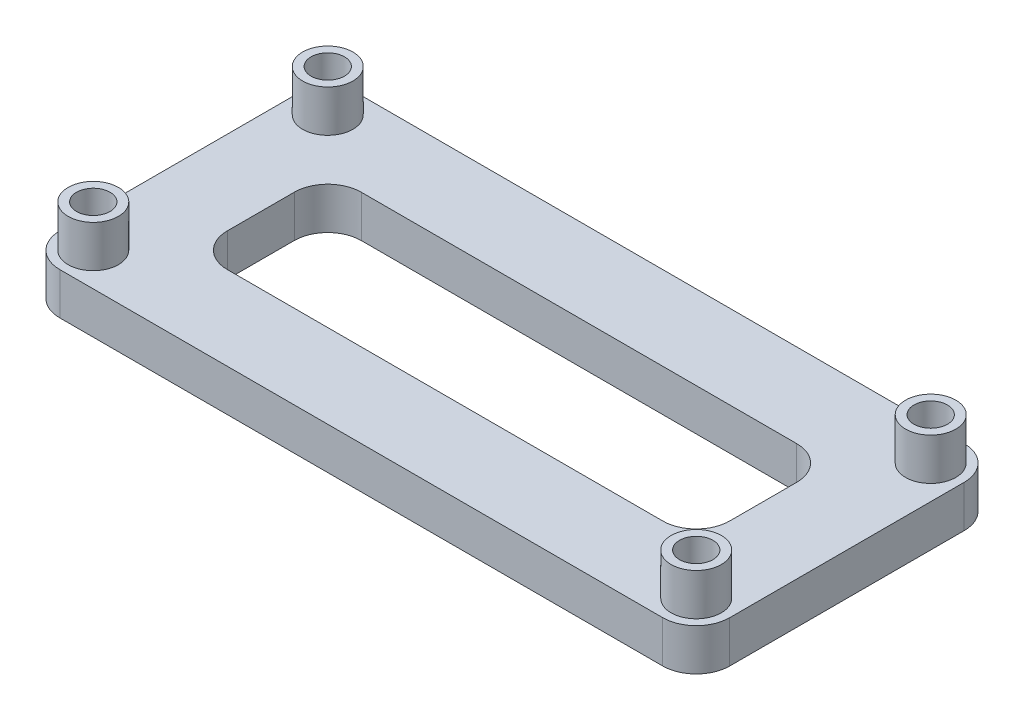
ISO-10303-21;
HEADER;
FILE_DESCRIPTION(('STEP AP214'),'2;1');
FILE_NAME('part.step','',(''),(''),'','','');
FILE_SCHEMA(('AUTOMOTIVE_DESIGN { 1 0 10303 214 1 1 1 1 }'));
ENDSEC;
DATA;
#1=APPLICATION_CONTEXT('core data for automotive mechanical design processes');
#2=APPLICATION_PROTOCOL_DEFINITION('international standard','automotive_design',2000,#1);
#3=PRODUCT_CONTEXT('',#1,'mechanical');
#4=PRODUCT('Part','Part','',(#3));
#5=PRODUCT_RELATED_PRODUCT_CATEGORY('part','',(#4));
#6=PRODUCT_DEFINITION_FORMATION('','',#4);
#7=PRODUCT_DEFINITION_CONTEXT('part definition',#1,'design');
#8=PRODUCT_DEFINITION('design','',#6,#7);
#9=PRODUCT_DEFINITION_SHAPE('','',#8);
#10=(LENGTH_UNIT() NAMED_UNIT(*) SI_UNIT(.MILLI.,.METRE.));
#11=(NAMED_UNIT(*) PLANE_ANGLE_UNIT() SI_UNIT($,.RADIAN.));
#12=(NAMED_UNIT(*) SI_UNIT($,.STERADIAN.) SOLID_ANGLE_UNIT());
#13=UNCERTAINTY_MEASURE_WITH_UNIT(LENGTH_MEASURE(1.E-05),#10,'distance_accuracy_value','');
#14=(GEOMETRIC_REPRESENTATION_CONTEXT(3) GLOBAL_UNCERTAINTY_ASSIGNED_CONTEXT((#13)) GLOBAL_UNIT_ASSIGNED_CONTEXT((#10,
#11,#12)) REPRESENTATION_CONTEXT('',''));
#15=CARTESIAN_POINT('',(0.,0.,0.));
#16=DIRECTION('',(0.,0.,1.));
#17=DIRECTION('',(1.,0.,0.));
#18=AXIS2_PLACEMENT_3D('',#15,#16,#17);
#19=CARTESIAN_POINT('',(0.,3.175,0.));
#20=DIRECTION('',(0.,-1.,0.));
#21=DIRECTION('',(0.,0.,-1.));
#22=AXIS2_PLACEMENT_3D('',#19,#20,#21);
#23=PLANE('',#22);
#24=CARTESIAN_POINT('',(48.26,3.175,-2.54));
#25=DIRECTION('',(0.,-1.,0.));
#26=DIRECTION('',(0.,0.,-1.));
#27=AXIS2_PLACEMENT_3D('',#24,#25,#26);
#28=CIRCLE('',#27,1.905);
#29=CARTESIAN_POINT('',(48.26,3.175,-4.445));
#30=VERTEX_POINT('',#29);
#31=EDGE_CURVE('E176',#30,#30,#28,.F.);
#32=ORIENTED_EDGE('',*,*,#31,.F.);
#33=EDGE_LOOP('',(#32));
#34=FACE_BOUND('',#33,.T.);
#35=CARTESIAN_POINT('',(2.54,3.175,-20.32));
#36=DIRECTION('',(0.,-1.,0.));
#37=DIRECTION('',(0.,0.,-1.));
#38=AXIS2_PLACEMENT_3D('',#35,#36,#37);
#39=CIRCLE('',#38,1.905);
#40=CARTESIAN_POINT('',(2.54,3.175,-22.225));
#41=VERTEX_POINT('',#40);
#42=EDGE_CURVE('E290',#41,#41,#39,.F.);
#43=ORIENTED_EDGE('',*,*,#42,.F.);
#44=EDGE_LOOP('',(#43));
#45=FACE_BOUND('',#44,.T.);
#46=DIRECTION('',(1.,0.,0.));
#47=VECTOR('',#46,1.);
#48=CARTESIAN_POINT('',(0.,3.175,0.));
#49=LINE('',#48,#47);
#50=CARTESIAN_POINT('',(2.54,3.175,0.));
#51=VERTEX_POINT('',#50);
#52=CARTESIAN_POINT('',(48.26,3.175,0.));
#53=VERTEX_POINT('',#52);
#54=EDGE_CURVE('E282',#51,#53,#49,.T.);
#55=ORIENTED_EDGE('',*,*,#54,.T.);
#56=CARTESIAN_POINT('',(48.26,3.175,-2.54));
#57=DIRECTION('',(0.,-1.,0.));
#58=DIRECTION('',(0.,0.,-1.));
#59=AXIS2_PLACEMENT_3D('',#56,#57,#58);
#60=CIRCLE('',#59,2.54);
#61=CARTESIAN_POINT('',(50.8,3.175,-2.54));
#62=VERTEX_POINT('',#61);
#63=EDGE_CURVE('E216',#53,#62,#60,.F.);
#64=ORIENTED_EDGE('',*,*,#63,.T.);
#65=DIRECTION('',(0.,0.,-1.));
#66=VECTOR('',#65,1.);
#67=CARTESIAN_POINT('',(50.8,3.175,0.));
#68=LINE('',#67,#66);
#69=CARTESIAN_POINT('',(50.8,3.175,-20.32));
#70=VERTEX_POINT('',#69);
#71=EDGE_CURVE('E286',#62,#70,#68,.T.);
#72=ORIENTED_EDGE('',*,*,#71,.T.);
#73=CARTESIAN_POINT('',(48.26,3.175,-20.32));
#74=DIRECTION('',(0.,-1.,0.));
#75=DIRECTION('',(0.,0.,-1.));
#76=AXIS2_PLACEMENT_3D('',#73,#74,#75);
#77=CIRCLE('',#76,2.54);
#78=CARTESIAN_POINT('',(48.26,3.175,-22.86));
#79=VERTEX_POINT('',#78);
#80=EDGE_CURVE('E55',#70,#79,#77,.F.);
#81=ORIENTED_EDGE('',*,*,#80,.T.);
#82=DIRECTION('',(-1.,0.,0.));
#83=VECTOR('',#82,1.);
#84=CARTESIAN_POINT('',(0.,3.175,-22.86));
#85=LINE('',#84,#83);
#86=CARTESIAN_POINT('',(2.54,3.175,-22.86));
#87=VERTEX_POINT('',#86);
#88=EDGE_CURVE('E288',#79,#87,#85,.T.);
#89=ORIENTED_EDGE('',*,*,#88,.T.);
#90=CARTESIAN_POINT('',(2.54,3.175,-20.32));
#91=DIRECTION('',(0.,-1.,0.));
#92=DIRECTION('',(0.,0.,-1.));
#93=AXIS2_PLACEMENT_3D('',#90,#91,#92);
#94=CIRCLE('',#93,2.54);
#95=CARTESIAN_POINT('',(0.,3.175,-20.32));
#96=VERTEX_POINT('',#95);
#97=EDGE_CURVE('E213',#87,#96,#94,.F.);
#98=ORIENTED_EDGE('',*,*,#97,.T.);
#99=DIRECTION('',(0.,0.,1.));
#100=VECTOR('',#99,1.);
#101=CARTESIAN_POINT('',(0.,3.175,0.));
#102=LINE('',#101,#100);
#103=CARTESIAN_POINT('',(0.,3.175,-2.54));
#104=VERTEX_POINT('',#103);
#105=EDGE_CURVE('E279',#96,#104,#102,.T.);
#106=ORIENTED_EDGE('',*,*,#105,.T.);
#107=CARTESIAN_POINT('',(2.54,3.175,-2.54));
#108=DIRECTION('',(0.,-1.,0.));
#109=DIRECTION('',(0.,0.,-1.));
#110=AXIS2_PLACEMENT_3D('',#107,#108,#109);
#111=CIRCLE('',#110,2.54);
#112=EDGE_CURVE('E211',#104,#51,#111,.F.);
#113=ORIENTED_EDGE('',*,*,#112,.T.);
#114=EDGE_LOOP('',(#55,#64,#72,#81,#89,#98,#106,#113));
#115=FACE_BOUND('',#114,.T.);
#116=DIRECTION('',(0.,0.,1.));
#117=VECTOR('',#116,1.);
#118=CARTESIAN_POINT('',(6.35,3.175,-16.51));
#119=LINE('',#118,#117);
#120=CARTESIAN_POINT('',(6.35,3.175,-13.97));
#121=VERTEX_POINT('',#120);
#122=CARTESIAN_POINT('',(6.35,3.175,-8.89));
#123=VERTEX_POINT('',#122);
#124=EDGE_CURVE('E260',#121,#123,#119,.T.);
#125=ORIENTED_EDGE('',*,*,#124,.F.);
#126=CARTESIAN_POINT('',(8.89,3.175,-13.97));
#127=DIRECTION('',(0.,-1.,0.));
#128=DIRECTION('',(0.,0.,-1.));
#129=AXIS2_PLACEMENT_3D('',#126,#127,#128);
#130=CIRCLE('',#129,2.54);
#131=CARTESIAN_POINT('',(8.89,3.175,-16.51));
#132=VERTEX_POINT('',#131);
#133=EDGE_CURVE('E11',#121,#132,#130,.T.);
#134=ORIENTED_EDGE('',*,*,#133,.T.);
#135=DIRECTION('',(-1.,0.,0.));
#136=VECTOR('',#135,1.);
#137=CARTESIAN_POINT('',(6.35,3.175,-16.51));
#138=LINE('',#137,#136);
#139=CARTESIAN_POINT('',(41.91,3.175,-16.51));
#140=VERTEX_POINT('',#139);
#141=EDGE_CURVE('E246',#140,#132,#138,.T.);
#142=ORIENTED_EDGE('',*,*,#141,.F.);
#143=CARTESIAN_POINT('',(41.91,3.175,-13.97));
#144=DIRECTION('',(0.,-1.,0.));
#145=DIRECTION('',(0.,0.,-1.));
#146=AXIS2_PLACEMENT_3D('',#143,#144,#145);
#147=CIRCLE('',#146,2.54);
#148=CARTESIAN_POINT('',(44.45,3.175,-13.97));
#149=VERTEX_POINT('',#148);
#150=EDGE_CURVE('E157',#140,#149,#147,.T.);
#151=ORIENTED_EDGE('',*,*,#150,.T.);
#152=DIRECTION('',(0.,0.,-1.));
#153=VECTOR('',#152,1.);
#154=CARTESIAN_POINT('',(44.45,3.175,-16.51));
#155=LINE('',#154,#153);
#156=CARTESIAN_POINT('',(44.45,3.175,-8.89));
#157=VERTEX_POINT('',#156);
#158=EDGE_CURVE('E243',#157,#149,#155,.T.);
#159=ORIENTED_EDGE('',*,*,#158,.F.);
#160=CARTESIAN_POINT('',(41.91,3.175,-8.89));
#161=DIRECTION('',(0.,-1.,0.));
#162=DIRECTION('',(0.,0.,-1.));
#163=AXIS2_PLACEMENT_3D('',#160,#161,#162);
#164=CIRCLE('',#163,2.54);
#165=CARTESIAN_POINT('',(41.91,3.175,-6.35));
#166=VERTEX_POINT('',#165);
#167=EDGE_CURVE('E233',#157,#166,#164,.T.);
#168=ORIENTED_EDGE('',*,*,#167,.T.);
#169=DIRECTION('',(1.,0.,0.));
#170=VECTOR('',#169,1.);
#171=CARTESIAN_POINT('',(6.35,3.175,-6.35));
#172=LINE('',#171,#170);
#173=CARTESIAN_POINT('',(8.89,3.175,-6.35));
#174=VERTEX_POINT('',#173);
#175=EDGE_CURVE('E254',#174,#166,#172,.T.);
#176=ORIENTED_EDGE('',*,*,#175,.F.);
#177=CARTESIAN_POINT('',(8.89,3.175,-8.89));
#178=DIRECTION('',(0.,-1.,0.));
#179=DIRECTION('',(0.,0.,-1.));
#180=AXIS2_PLACEMENT_3D('',#177,#178,#179);
#181=CIRCLE('',#180,2.54);
#182=EDGE_CURVE('E229',#174,#123,#181,.T.);
#183=ORIENTED_EDGE('',*,*,#182,.T.);
#184=EDGE_LOOP('',(#125,#134,#142,#151,#159,#168,#176,#183));
#185=FACE_BOUND('',#184,.T.);
#186=CARTESIAN_POINT('',(2.54,3.175,-2.54));
#187=DIRECTION('',(0.,-1.,0.));
#188=DIRECTION('',(0.,0.,-1.));
#189=AXIS2_PLACEMENT_3D('',#186,#187,#188);
#190=CIRCLE('',#189,1.905);
#191=CARTESIAN_POINT('',(2.54,3.175,-4.445));
#192=VERTEX_POINT('',#191);
#193=EDGE_CURVE('E302',#192,#192,#190,.F.);
#194=ORIENTED_EDGE('',*,*,#193,.F.);
#195=EDGE_LOOP('',(#194));
#196=FACE_BOUND('',#195,.T.);
#197=CARTESIAN_POINT('',(48.26,3.175,-20.32));
#198=DIRECTION('',(0.,-1.,0.));
#199=DIRECTION('',(0.,0.,-1.));
#200=AXIS2_PLACEMENT_3D('',#197,#198,#199);
#201=CIRCLE('',#200,1.905);
#202=CARTESIAN_POINT('',(48.26,3.175,-22.225));
#203=VERTEX_POINT('',#202);
#204=EDGE_CURVE('E171',#203,#203,#201,.F.);
#205=ORIENTED_EDGE('',*,*,#204,.F.);
#206=EDGE_LOOP('',(#205));
#207=FACE_BOUND('',#206,.T.);
#208=ADVANCED_FACE('F33',(#34,#45,#115,#185,#196,#207),#23,.F.);
#209=CARTESIAN_POINT('',(0.,0.,0.));
#210=DIRECTION('',(0.,-1.,0.));
#211=DIRECTION('',(0.,0.,-1.));
#212=AXIS2_PLACEMENT_3D('',#209,#210,#211);
#213=PLANE('',#212);
#214=CARTESIAN_POINT('',(48.26,0.,-2.54));
#215=DIRECTION('',(0.,1.,0.));
#216=DIRECTION('',(0.,0.,1.));
#217=AXIS2_PLACEMENT_3D('',#214,#215,#216);
#218=CIRCLE('',#217,1.27);
#219=CARTESIAN_POINT('',(48.26,0.,-1.27));
#220=VERTEX_POINT('',#219);
#221=EDGE_CURVE('E266',#220,#220,#218,.T.);
#222=ORIENTED_EDGE('',*,*,#221,.T.);
#223=EDGE_LOOP('',(#222));
#224=FACE_BOUND('',#223,.T.);
#225=CARTESIAN_POINT('',(48.26,0.,-20.32));
#226=DIRECTION('',(0.,1.,0.));
#227=DIRECTION('',(0.,0.,1.));
#228=AXIS2_PLACEMENT_3D('',#225,#226,#227);
#229=CIRCLE('',#228,1.27);
#230=CARTESIAN_POINT('',(48.26,0.,-19.05));
#231=VERTEX_POINT('',#230);
#232=EDGE_CURVE('E272',#231,#231,#229,.T.);
#233=ORIENTED_EDGE('',*,*,#232,.T.);
#234=EDGE_LOOP('',(#233));
#235=FACE_BOUND('',#234,.T.);
#236=DIRECTION('',(0.,0.,-1.));
#237=VECTOR('',#236,1.);
#238=CARTESIAN_POINT('',(50.8,0.,0.));
#239=LINE('',#238,#237);
#240=CARTESIAN_POINT('',(50.8,0.,-2.54));
#241=VERTEX_POINT('',#240);
#242=CARTESIAN_POINT('',(50.8,0.,-20.32));
#243=VERTEX_POINT('',#242);
#244=EDGE_CURVE('E296',#241,#243,#239,.T.);
#245=ORIENTED_EDGE('',*,*,#244,.F.);
#246=CARTESIAN_POINT('',(48.26,0.,-2.54));
#247=DIRECTION('',(0.,-1.,0.));
#248=DIRECTION('',(0.,0.,-1.));
#249=AXIS2_PLACEMENT_3D('',#246,#247,#248);
#250=CIRCLE('',#249,2.54);
#251=CARTESIAN_POINT('',(48.26,0.,0.));
#252=VERTEX_POINT('',#251);
#253=EDGE_CURVE('E204',#241,#252,#250,.T.);
#254=ORIENTED_EDGE('',*,*,#253,.T.);
#255=DIRECTION('',(1.,0.,0.));
#256=VECTOR('',#255,1.);
#257=CARTESIAN_POINT('',(0.,0.,0.));
#258=LINE('',#257,#256);
#259=CARTESIAN_POINT('',(2.54,0.,0.));
#260=VERTEX_POINT('',#259);
#261=EDGE_CURVE('E293',#260,#252,#258,.T.);
#262=ORIENTED_EDGE('',*,*,#261,.F.);
#263=CARTESIAN_POINT('',(2.54,0.,-2.54));
#264=DIRECTION('',(0.,-1.,0.));
#265=DIRECTION('',(0.,0.,-1.));
#266=AXIS2_PLACEMENT_3D('',#263,#264,#265);
#267=CIRCLE('',#266,2.54);
#268=CARTESIAN_POINT('',(0.,0.,-2.54));
#269=VERTEX_POINT('',#268);
#270=EDGE_CURVE('E198',#260,#269,#267,.T.);
#271=ORIENTED_EDGE('',*,*,#270,.T.);
#272=DIRECTION('',(0.,0.,1.));
#273=VECTOR('',#272,1.);
#274=CARTESIAN_POINT('',(0.,0.,0.));
#275=LINE('',#274,#273);
#276=CARTESIAN_POINT('',(0.,0.,-20.32));
#277=VERTEX_POINT('',#276);
#278=EDGE_CURVE('E278',#277,#269,#275,.T.);
#279=ORIENTED_EDGE('',*,*,#278,.F.);
#280=CARTESIAN_POINT('',(2.54,0.,-20.32));
#281=DIRECTION('',(0.,-1.,0.));
#282=DIRECTION('',(0.,0.,-1.));
#283=AXIS2_PLACEMENT_3D('',#280,#281,#282);
#284=CIRCLE('',#283,2.54);
#285=CARTESIAN_POINT('',(2.54,0.,-22.86));
#286=VERTEX_POINT('',#285);
#287=EDGE_CURVE('E200',#277,#286,#284,.T.);
#288=ORIENTED_EDGE('',*,*,#287,.T.);
#289=DIRECTION('',(-1.,0.,0.));
#290=VECTOR('',#289,1.);
#291=CARTESIAN_POINT('',(0.,0.,-22.86));
#292=LINE('',#291,#290);
#293=CARTESIAN_POINT('',(48.26,0.,-22.86));
#294=VERTEX_POINT('',#293);
#295=EDGE_CURVE('E283',#294,#286,#292,.T.);
#296=ORIENTED_EDGE('',*,*,#295,.F.);
#297=CARTESIAN_POINT('',(48.26,0.,-20.32));
#298=DIRECTION('',(0.,-1.,0.));
#299=DIRECTION('',(0.,0.,-1.));
#300=AXIS2_PLACEMENT_3D('',#297,#298,#299);
#301=CIRCLE('',#300,2.54);
#302=EDGE_CURVE('E202',#294,#243,#301,.T.);
#303=ORIENTED_EDGE('',*,*,#302,.T.);
#304=EDGE_LOOP('',(#245,#254,#262,#271,#279,#288,#296,#303));
#305=FACE_BOUND('',#304,.T.);
#306=CARTESIAN_POINT('',(2.54,0.,-20.32));
#307=DIRECTION('',(0.,1.,0.));
#308=DIRECTION('',(0.,0.,1.));
#309=AXIS2_PLACEMENT_3D('',#306,#307,#308);
#310=CIRCLE('',#309,1.27);
#311=CARTESIAN_POINT('',(2.54,0.,-19.05));
#312=VERTEX_POINT('',#311);
#313=EDGE_CURVE('E275',#312,#312,#310,.T.);
#314=ORIENTED_EDGE('',*,*,#313,.T.);
#315=EDGE_LOOP('',(#314));
#316=FACE_BOUND('',#315,.T.);
#317=CARTESIAN_POINT('',(2.54,0.,-2.54));
#318=DIRECTION('',(0.,1.,0.));
#319=DIRECTION('',(0.,0.,1.));
#320=AXIS2_PLACEMENT_3D('',#317,#318,#319);
#321=CIRCLE('',#320,1.27);
#322=CARTESIAN_POINT('',(2.54,0.,-1.27));
#323=VERTEX_POINT('',#322);
#324=EDGE_CURVE('E269',#323,#323,#321,.T.);
#325=ORIENTED_EDGE('',*,*,#324,.T.);
#326=EDGE_LOOP('',(#325));
#327=FACE_BOUND('',#326,.T.);
#328=DIRECTION('',(0.,0.,-1.));
#329=VECTOR('',#328,1.);
#330=CARTESIAN_POINT('',(44.45,0.,-16.51));
#331=LINE('',#330,#329);
#332=CARTESIAN_POINT('',(44.45,0.,-8.89));
#333=VERTEX_POINT('',#332);
#334=CARTESIAN_POINT('',(44.45,0.,-13.97));
#335=VERTEX_POINT('',#334);
#336=EDGE_CURVE('E257',#333,#335,#331,.T.);
#337=ORIENTED_EDGE('',*,*,#336,.T.);
#338=CARTESIAN_POINT('',(41.91,0.,-13.97));
#339=DIRECTION('',(0.,-1.,0.));
#340=DIRECTION('',(0.,0.,-1.));
#341=AXIS2_PLACEMENT_3D('',#338,#339,#340);
#342=CIRCLE('',#341,2.54);
#343=CARTESIAN_POINT('',(41.91,0.,-16.51));
#344=VERTEX_POINT('',#343);
#345=EDGE_CURVE('E235',#335,#344,#342,.F.);
#346=ORIENTED_EDGE('',*,*,#345,.T.);
#347=DIRECTION('',(-1.,0.,0.));
#348=VECTOR('',#347,1.);
#349=CARTESIAN_POINT('',(6.35,0.,-16.51));
#350=LINE('',#349,#348);
#351=CARTESIAN_POINT('',(8.89,0.,-16.51));
#352=VERTEX_POINT('',#351);
#353=EDGE_CURVE('E152',#344,#352,#350,.T.);
#354=ORIENTED_EDGE('',*,*,#353,.T.);
#355=CARTESIAN_POINT('',(8.89,0.,-13.97));
#356=DIRECTION('',(0.,-1.,0.));
#357=DIRECTION('',(0.,0.,-1.));
#358=AXIS2_PLACEMENT_3D('',#355,#356,#357);
#359=CIRCLE('',#358,2.54);
#360=CARTESIAN_POINT('',(6.35,0.,-13.97));
#361=VERTEX_POINT('',#360);
#362=EDGE_CURVE('E41',#352,#361,#359,.F.);
#363=ORIENTED_EDGE('',*,*,#362,.T.);
#364=DIRECTION('',(0.,0.,1.));
#365=VECTOR('',#364,1.);
#366=CARTESIAN_POINT('',(6.35,0.,-16.51));
#367=LINE('',#366,#365);
#368=CARTESIAN_POINT('',(6.35,0.,-8.89));
#369=VERTEX_POINT('',#368);
#370=EDGE_CURVE('E150',#361,#369,#367,.T.);
#371=ORIENTED_EDGE('',*,*,#370,.T.);
#372=CARTESIAN_POINT('',(8.89,0.,-8.89));
#373=DIRECTION('',(0.,-1.,0.));
#374=DIRECTION('',(0.,0.,-1.));
#375=AXIS2_PLACEMENT_3D('',#372,#373,#374);
#376=CIRCLE('',#375,2.54);
#377=CARTESIAN_POINT('',(8.89,0.,-6.35));
#378=VERTEX_POINT('',#377);
#379=EDGE_CURVE('E227',#369,#378,#376,.F.);
#380=ORIENTED_EDGE('',*,*,#379,.T.);
#381=DIRECTION('',(1.,0.,0.));
#382=VECTOR('',#381,1.);
#383=CARTESIAN_POINT('',(6.35,0.,-6.35));
#384=LINE('',#383,#382);
#385=CARTESIAN_POINT('',(41.91,0.,-6.35));
#386=VERTEX_POINT('',#385);
#387=EDGE_CURVE('E166',#378,#386,#384,.T.);
#388=ORIENTED_EDGE('',*,*,#387,.T.);
#389=CARTESIAN_POINT('',(41.91,0.,-8.89));
#390=DIRECTION('',(0.,-1.,0.));
#391=DIRECTION('',(0.,0.,-1.));
#392=AXIS2_PLACEMENT_3D('',#389,#390,#391);
#393=CIRCLE('',#392,2.54);
#394=EDGE_CURVE('E231',#386,#333,#393,.F.);
#395=ORIENTED_EDGE('',*,*,#394,.T.);
#396=EDGE_LOOP('',(#337,#346,#354,#363,#371,#380,#388,#395));
#397=FACE_BOUND('',#396,.T.);
#398=ADVANCED_FACE('F149',(#224,#235,#305,#316,#327,#397),#213,.T.);
#399=CARTESIAN_POINT('',(0.,3.175,0.));
#400=DIRECTION('',(1.,0.,0.));
#401=DIRECTION('',(0.,0.,-1.));
#402=AXIS2_PLACEMENT_3D('',#399,#400,#401);
#403=PLANE('',#402);
#404=ORIENTED_EDGE('',*,*,#105,.F.);
#405=DIRECTION('',(0.,-1.,0.));
#406=VECTOR('',#405,1.);
#407=CARTESIAN_POINT('',(0.,3.175,-20.32));
#408=LINE('',#407,#406);
#409=EDGE_CURVE('E224',#96,#277,#408,.T.);
#410=ORIENTED_EDGE('',*,*,#409,.T.);
#411=ORIENTED_EDGE('',*,*,#278,.T.);
#412=DIRECTION('',(0.,-1.,0.));
#413=VECTOR('',#412,1.);
#414=CARTESIAN_POINT('',(0.,3.175,-2.54));
#415=LINE('',#414,#413);
#416=EDGE_CURVE('E222',#269,#104,#415,.F.);
#417=ORIENTED_EDGE('',*,*,#416,.T.);
#418=EDGE_LOOP('',(#404,#410,#411,#417));
#419=FACE_BOUND('',#418,.T.);
#420=ADVANCED_FACE('F342',(#419),#403,.F.);
#421=CARTESIAN_POINT('',(0.,3.175,0.));
#422=DIRECTION('',(0.,0.,-1.));
#423=DIRECTION('',(-1.,0.,0.));
#424=AXIS2_PLACEMENT_3D('',#421,#422,#423);
#425=PLANE('',#424);
#426=ORIENTED_EDGE('',*,*,#261,.T.);
#427=DIRECTION('',(0.,-1.,0.));
#428=VECTOR('',#427,1.);
#429=CARTESIAN_POINT('',(48.26,3.175,0.));
#430=LINE('',#429,#428);
#431=EDGE_CURVE('E209',#252,#53,#430,.F.);
#432=ORIENTED_EDGE('',*,*,#431,.T.);
#433=ORIENTED_EDGE('',*,*,#54,.F.);
#434=DIRECTION('',(0.,-1.,0.));
#435=VECTOR('',#434,1.);
#436=CARTESIAN_POINT('',(2.54,3.175,0.));
#437=LINE('',#436,#435);
#438=EDGE_CURVE('E206',#51,#260,#437,.T.);
#439=ORIENTED_EDGE('',*,*,#438,.T.);
#440=EDGE_LOOP('',(#426,#432,#433,#439));
#441=FACE_BOUND('',#440,.T.);
#442=ADVANCED_FACE('F345',(#441),#425,.F.);
#443=CARTESIAN_POINT('',(50.8,3.175,0.));
#444=DIRECTION('',(-1.,0.,0.));
#445=DIRECTION('',(0.,0.,1.));
#446=AXIS2_PLACEMENT_3D('',#443,#444,#445);
#447=PLANE('',#446);
#448=ORIENTED_EDGE('',*,*,#71,.F.);
#449=DIRECTION('',(0.,-1.,0.));
#450=VECTOR('',#449,1.);
#451=CARTESIAN_POINT('',(50.8,3.175,-2.54));
#452=LINE('',#451,#450);
#453=EDGE_CURVE('E195',#62,#241,#452,.T.);
#454=ORIENTED_EDGE('',*,*,#453,.T.);
#455=ORIENTED_EDGE('',*,*,#244,.T.);
#456=DIRECTION('',(0.,-1.,0.));
#457=VECTOR('',#456,1.);
#458=CARTESIAN_POINT('',(50.8,3.175,-20.32));
#459=LINE('',#458,#457);
#460=EDGE_CURVE('E193',#243,#70,#459,.F.);
#461=ORIENTED_EDGE('',*,*,#460,.T.);
#462=EDGE_LOOP('',(#448,#454,#455,#461));
#463=FACE_BOUND('',#462,.T.);
#464=ADVANCED_FACE('F325',(#463),#447,.F.);
#465=CARTESIAN_POINT('',(0.,3.175,-22.86));
#466=DIRECTION('',(0.,0.,1.));
#467=DIRECTION('',(1.,0.,0.));
#468=AXIS2_PLACEMENT_3D('',#465,#466,#467);
#469=PLANE('',#468);
#470=ORIENTED_EDGE('',*,*,#88,.F.);
#471=DIRECTION('',(0.,-1.,0.));
#472=VECTOR('',#471,1.);
#473=CARTESIAN_POINT('',(48.26,3.175,-22.86));
#474=LINE('',#473,#472);
#475=EDGE_CURVE('E219',#79,#294,#474,.T.);
#476=ORIENTED_EDGE('',*,*,#475,.T.);
#477=ORIENTED_EDGE('',*,*,#295,.T.);
#478=DIRECTION('',(0.,-1.,0.));
#479=VECTOR('',#478,1.);
#480=CARTESIAN_POINT('',(2.54,3.175,-22.86));
#481=LINE('',#480,#479);
#482=EDGE_CURVE('E48',#286,#87,#481,.F.);
#483=ORIENTED_EDGE('',*,*,#482,.T.);
#484=EDGE_LOOP('',(#470,#476,#477,#483));
#485=FACE_BOUND('',#484,.T.);
#486=ADVANCED_FACE('F334',(#485),#469,.F.);
#487=CARTESIAN_POINT('',(2.54,3.175,-20.32));
#488=DIRECTION('',(0.,-1.,0.));
#489=DIRECTION('',(0.,0.,-1.));
#490=AXIS2_PLACEMENT_3D('',#487,#488,#489);
#491=CYLINDRICAL_SURFACE('',#490,1.27);
#492=ORIENTED_EDGE('',*,*,#313,.F.);
#493=EDGE_LOOP('',(#492));
#494=FACE_BOUND('',#493,.T.);
#495=CARTESIAN_POINT('',(2.54,6.35,-20.32));
#496=DIRECTION('',(0.,1.,0.));
#497=DIRECTION('',(0.,0.,1.));
#498=AXIS2_PLACEMENT_3D('',#495,#496,#497);
#499=CIRCLE('',#498,1.27);
#500=CARTESIAN_POINT('',(2.54,6.35,-19.05));
#501=VERTEX_POINT('',#500);
#502=EDGE_CURVE('E628',#501,#501,#499,.T.);
#503=ORIENTED_EDGE('',*,*,#502,.T.);
#504=EDGE_LOOP('',(#503));
#505=FACE_BOUND('',#504,.T.);
#506=ADVANCED_FACE('F469',(#494,#505),#491,.F.);
#507=CARTESIAN_POINT('',(48.26,3.175,-20.32));
#508=DIRECTION('',(0.,-1.,0.));
#509=DIRECTION('',(0.,0.,-1.));
#510=AXIS2_PLACEMENT_3D('',#507,#508,#509);
#511=CYLINDRICAL_SURFACE('',#510,1.27);
#512=ORIENTED_EDGE('',*,*,#232,.F.);
#513=EDGE_LOOP('',(#512));
#514=FACE_BOUND('',#513,.T.);
#515=CARTESIAN_POINT('',(48.26,6.35,-20.32));
#516=DIRECTION('',(0.,1.,0.));
#517=DIRECTION('',(0.,0.,-1.));
#518=AXIS2_PLACEMENT_3D('',#515,#516,#517);
#519=CIRCLE('',#518,1.27);
#520=CARTESIAN_POINT('',(48.26,6.35,-21.59));
#521=VERTEX_POINT('',#520);
#522=EDGE_CURVE('E658',#521,#521,#519,.T.);
#523=ORIENTED_EDGE('',*,*,#522,.T.);
#524=EDGE_LOOP('',(#523));
#525=FACE_BOUND('',#524,.T.);
#526=ADVANCED_FACE('F593',(#514,#525),#511,.F.);
#527=CARTESIAN_POINT('',(2.54,3.175,-2.54));
#528=DIRECTION('',(0.,-1.,0.));
#529=DIRECTION('',(0.,0.,-1.));
#530=AXIS2_PLACEMENT_3D('',#527,#528,#529);
#531=CYLINDRICAL_SURFACE('',#530,1.27);
#532=ORIENTED_EDGE('',*,*,#324,.F.);
#533=EDGE_LOOP('',(#532));
#534=FACE_BOUND('',#533,.T.);
#535=CARTESIAN_POINT('',(2.54,6.35,-2.54));
#536=DIRECTION('',(0.,1.,0.));
#537=DIRECTION('',(0.,0.,-1.));
#538=AXIS2_PLACEMENT_3D('',#535,#536,#537);
#539=CIRCLE('',#538,1.27);
#540=CARTESIAN_POINT('',(2.54,6.35,-3.81));
#541=VERTEX_POINT('',#540);
#542=EDGE_CURVE('E635',#541,#541,#539,.T.);
#543=ORIENTED_EDGE('',*,*,#542,.T.);
#544=EDGE_LOOP('',(#543));
#545=FACE_BOUND('',#544,.T.);
#546=ADVANCED_FACE('F583',(#534,#545),#531,.F.);
#547=CARTESIAN_POINT('',(48.26,3.175,-2.54));
#548=DIRECTION('',(0.,-1.,0.));
#549=DIRECTION('',(0.,0.,-1.));
#550=AXIS2_PLACEMENT_3D('',#547,#548,#549);
#551=CYLINDRICAL_SURFACE('',#550,1.27);
#552=ORIENTED_EDGE('',*,*,#221,.F.);
#553=EDGE_LOOP('',(#552));
#554=FACE_BOUND('',#553,.T.);
#555=CARTESIAN_POINT('',(48.26,6.35,-2.54));
#556=DIRECTION('',(0.,1.,0.));
#557=DIRECTION('',(0.,0.,1.));
#558=AXIS2_PLACEMENT_3D('',#555,#556,#557);
#559=CIRCLE('',#558,1.27);
#560=CARTESIAN_POINT('',(48.26,6.35,-1.27));
#561=VERTEX_POINT('',#560);
#562=EDGE_CURVE('E652',#561,#561,#559,.T.);
#563=ORIENTED_EDGE('',*,*,#562,.T.);
#564=EDGE_LOOP('',(#563));
#565=FACE_BOUND('',#564,.T.);
#566=ADVANCED_FACE('F458',(#554,#565),#551,.F.);
#567=CARTESIAN_POINT('',(6.35,3.175,-16.51));
#568=DIRECTION('',(1.,0.,0.));
#569=DIRECTION('',(0.,0.,-1.));
#570=AXIS2_PLACEMENT_3D('',#567,#568,#569);
#571=PLANE('',#570);
#572=ORIENTED_EDGE('',*,*,#124,.T.);
#573=DIRECTION('',(0.,-1.,0.));
#574=VECTOR('',#573,1.);
#575=CARTESIAN_POINT('',(6.35,0.,-8.89));
#576=LINE('',#575,#574);
#577=EDGE_CURVE('E165',#123,#369,#576,.T.);
#578=ORIENTED_EDGE('',*,*,#577,.T.);
#579=ORIENTED_EDGE('',*,*,#370,.F.);
#580=DIRECTION('',(0.,-1.,0.));
#581=VECTOR('',#580,1.);
#582=CARTESIAN_POINT('',(6.35,3.175,-13.97));
#583=LINE('',#582,#581);
#584=EDGE_CURVE('E162',#361,#121,#583,.F.);
#585=ORIENTED_EDGE('',*,*,#584,.T.);
#586=EDGE_LOOP('',(#572,#578,#579,#585));
#587=FACE_BOUND('',#586,.T.);
#588=ADVANCED_FACE('F161',(#587),#571,.T.);
#589=CARTESIAN_POINT('',(6.35,3.175,-6.35));
#590=DIRECTION('',(0.,0.,-1.));
#591=DIRECTION('',(-1.,0.,0.));
#592=AXIS2_PLACEMENT_3D('',#589,#590,#591);
#593=PLANE('',#592);
#594=ORIENTED_EDGE('',*,*,#387,.F.);
#595=DIRECTION('',(0.,-1.,0.));
#596=VECTOR('',#595,1.);
#597=CARTESIAN_POINT('',(8.89,3.175,-6.35));
#598=LINE('',#597,#596);
#599=EDGE_CURVE('E182',#378,#174,#598,.F.);
#600=ORIENTED_EDGE('',*,*,#599,.T.);
#601=ORIENTED_EDGE('',*,*,#175,.T.);
#602=DIRECTION('',(0.,-1.,0.));
#603=VECTOR('',#602,1.);
#604=CARTESIAN_POINT('',(41.91,0.,-6.35));
#605=LINE('',#604,#603);
#606=EDGE_CURVE('E173',#166,#386,#605,.T.);
#607=ORIENTED_EDGE('',*,*,#606,.T.);
#608=EDGE_LOOP('',(#594,#600,#601,#607));
#609=FACE_BOUND('',#608,.T.);
#610=ADVANCED_FACE('F440',(#609),#593,.T.);
#611=CARTESIAN_POINT('',(44.45,3.175,-16.51));
#612=DIRECTION('',(-1.,0.,0.));
#613=DIRECTION('',(0.,0.,1.));
#614=AXIS2_PLACEMENT_3D('',#611,#612,#613);
#615=PLANE('',#614);
#616=ORIENTED_EDGE('',*,*,#336,.F.);
#617=DIRECTION('',(0.,-1.,0.));
#618=VECTOR('',#617,1.);
#619=CARTESIAN_POINT('',(44.45,3.175,-8.89));
#620=LINE('',#619,#618);
#621=EDGE_CURVE('E187',#333,#157,#620,.F.);
#622=ORIENTED_EDGE('',*,*,#621,.T.);
#623=ORIENTED_EDGE('',*,*,#158,.T.);
#624=DIRECTION('',(0.,-1.,0.));
#625=VECTOR('',#624,1.);
#626=CARTESIAN_POINT('',(44.45,0.,-13.97));
#627=LINE('',#626,#625);
#628=EDGE_CURVE('E184',#149,#335,#627,.T.);
#629=ORIENTED_EDGE('',*,*,#628,.T.);
#630=EDGE_LOOP('',(#616,#622,#623,#629));
#631=FACE_BOUND('',#630,.T.);
#632=ADVANCED_FACE('F252',(#631),#615,.T.);
#633=CARTESIAN_POINT('',(6.35,3.175,-16.51));
#634=DIRECTION('',(0.,0.,1.));
#635=DIRECTION('',(1.,0.,0.));
#636=AXIS2_PLACEMENT_3D('',#633,#634,#635);
#637=PLANE('',#636);
#638=ORIENTED_EDGE('',*,*,#353,.F.);
#639=DIRECTION('',(0.,-1.,0.));
#640=VECTOR('',#639,1.);
#641=CARTESIAN_POINT('',(41.91,3.175,-16.51));
#642=LINE('',#641,#640);
#643=EDGE_CURVE('E191',#344,#140,#642,.F.);
#644=ORIENTED_EDGE('',*,*,#643,.T.);
#645=ORIENTED_EDGE('',*,*,#141,.T.);
#646=DIRECTION('',(0.,-1.,0.));
#647=VECTOR('',#646,1.);
#648=CARTESIAN_POINT('',(8.89,0.,-16.51));
#649=LINE('',#648,#647);
#650=EDGE_CURVE('E189',#132,#352,#649,.T.);
#651=ORIENTED_EDGE('',*,*,#650,.T.);
#652=EDGE_LOOP('',(#638,#644,#645,#651));
#653=FACE_BOUND('',#652,.T.);
#654=ADVANCED_FACE('F259',(#653),#637,.T.);
#655=CARTESIAN_POINT('',(2.54,6.35,-20.32));
#656=DIRECTION('',(0.,1.,0.));
#657=DIRECTION('',(0.,0.,1.));
#658=AXIS2_PLACEMENT_3D('',#655,#656,#657);
#659=PLANE('',#658);
#660=CARTESIAN_POINT('',(2.54,6.35,-20.32));
#661=DIRECTION('',(0.,1.,0.));
#662=DIRECTION('',(0.,0.,1.));
#663=AXIS2_PLACEMENT_3D('',#660,#661,#662);
#664=CIRCLE('',#663,1.905);
#665=CARTESIAN_POINT('',(2.54,6.35,-18.415));
#666=VERTEX_POINT('',#665);
#667=EDGE_CURVE('E167',#666,#666,#664,.T.);
#668=ORIENTED_EDGE('',*,*,#667,.T.);
#669=EDGE_LOOP('',(#668));
#670=FACE_BOUND('',#669,.T.);
#671=ORIENTED_EDGE('',*,*,#502,.F.);
#672=EDGE_LOOP('',(#671));
#673=FACE_BOUND('',#672,.T.);
#674=ADVANCED_FACE('F429',(#670,#673),#659,.T.);
#675=CARTESIAN_POINT('',(2.54,6.35,-20.32));
#676=DIRECTION('',(0.,-1.,0.));
#677=DIRECTION('',(0.,0.,-1.));
#678=AXIS2_PLACEMENT_3D('',#675,#676,#677);
#679=CYLINDRICAL_SURFACE('',#678,1.905);
#680=ORIENTED_EDGE('',*,*,#667,.F.);
#681=EDGE_LOOP('',(#680));
#682=FACE_BOUND('',#681,.T.);
#683=ORIENTED_EDGE('',*,*,#42,.T.);
#684=EDGE_LOOP('',(#683));
#685=FACE_BOUND('',#684,.T.);
#686=ADVANCED_FACE('F557',(#682,#685),#679,.T.);
#687=CARTESIAN_POINT('',(2.54,6.35,-2.54));
#688=DIRECTION('',(0.,-1.,0.));
#689=DIRECTION('',(0.,0.,-1.));
#690=AXIS2_PLACEMENT_3D('',#687,#688,#689);
#691=PLANE('',#690);
#692=CARTESIAN_POINT('',(2.54,6.35,-2.54));
#693=DIRECTION('',(0.,1.,0.));
#694=DIRECTION('',(0.,0.,-1.));
#695=AXIS2_PLACEMENT_3D('',#692,#693,#694);
#696=CIRCLE('',#695,1.905);
#697=CARTESIAN_POINT('',(2.54,6.35,-4.445));
#698=VERTEX_POINT('',#697);
#699=EDGE_CURVE('E630',#698,#698,#696,.T.);
#700=ORIENTED_EDGE('',*,*,#699,.T.);
#701=EDGE_LOOP('',(#700));
#702=FACE_BOUND('',#701,.T.);
#703=ORIENTED_EDGE('',*,*,#542,.F.);
#704=EDGE_LOOP('',(#703));
#705=FACE_BOUND('',#704,.T.);
#706=ADVANCED_FACE('F547',(#702,#705),#691,.F.);
#707=CARTESIAN_POINT('',(2.54,6.35,-2.54));
#708=DIRECTION('',(0.,-1.,0.));
#709=DIRECTION('',(0.,0.,-1.));
#710=AXIS2_PLACEMENT_3D('',#707,#708,#709);
#711=CYLINDRICAL_SURFACE('',#710,1.905);
#712=ORIENTED_EDGE('',*,*,#699,.F.);
#713=EDGE_LOOP('',(#712));
#714=FACE_BOUND('',#713,.T.);
#715=ORIENTED_EDGE('',*,*,#193,.T.);
#716=EDGE_LOOP('',(#715));
#717=FACE_BOUND('',#716,.T.);
#718=ADVANCED_FACE('F537',(#714,#717),#711,.T.);
#719=CARTESIAN_POINT('',(48.26,6.35,-2.54));
#720=DIRECTION('',(0.,1.,0.));
#721=DIRECTION('',(0.,0.,1.));
#722=AXIS2_PLACEMENT_3D('',#719,#720,#721);
#723=PLANE('',#722);
#724=CARTESIAN_POINT('',(48.26,6.35,-2.54));
#725=DIRECTION('',(0.,1.,0.));
#726=DIRECTION('',(0.,0.,1.));
#727=AXIS2_PLACEMENT_3D('',#724,#725,#726);
#728=CIRCLE('',#727,1.905);
#729=CARTESIAN_POINT('',(48.26,6.35,-0.635000000000001));
#730=VERTEX_POINT('',#729);
#731=EDGE_CURVE('E649',#730,#730,#728,.T.);
#732=ORIENTED_EDGE('',*,*,#731,.T.);
#733=EDGE_LOOP('',(#732));
#734=FACE_BOUND('',#733,.T.);
#735=ORIENTED_EDGE('',*,*,#562,.F.);
#736=EDGE_LOOP('',(#735));
#737=FACE_BOUND('',#736,.T.);
#738=ADVANCED_FACE('F527',(#734,#737),#723,.T.);
#739=CARTESIAN_POINT('',(48.26,6.35,-2.54));
#740=DIRECTION('',(0.,-1.,0.));
#741=DIRECTION('',(0.,0.,-1.));
#742=AXIS2_PLACEMENT_3D('',#739,#740,#741);
#743=CYLINDRICAL_SURFACE('',#742,1.905);
#744=ORIENTED_EDGE('',*,*,#731,.F.);
#745=EDGE_LOOP('',(#744));
#746=FACE_BOUND('',#745,.T.);
#747=ORIENTED_EDGE('',*,*,#31,.T.);
#748=EDGE_LOOP('',(#747));
#749=FACE_BOUND('',#748,.T.);
#750=ADVANCED_FACE('F307',(#746,#749),#743,.T.);
#751=CARTESIAN_POINT('',(48.26,6.35,-20.32));
#752=DIRECTION('',(0.,-1.,0.));
#753=DIRECTION('',(0.,0.,-1.));
#754=AXIS2_PLACEMENT_3D('',#751,#752,#753);
#755=PLANE('',#754);
#756=CARTESIAN_POINT('',(48.26,6.35,-20.32));
#757=DIRECTION('',(0.,1.,0.));
#758=DIRECTION('',(0.,0.,-1.));
#759=AXIS2_PLACEMENT_3D('',#756,#757,#758);
#760=CIRCLE('',#759,1.905);
#761=CARTESIAN_POINT('',(48.26,6.35,-22.225));
#762=VERTEX_POINT('',#761);
#763=EDGE_CURVE('E655',#762,#762,#760,.T.);
#764=ORIENTED_EDGE('',*,*,#763,.T.);
#765=EDGE_LOOP('',(#764));
#766=FACE_BOUND('',#765,.T.);
#767=ORIENTED_EDGE('',*,*,#522,.F.);
#768=EDGE_LOOP('',(#767));
#769=FACE_BOUND('',#768,.T.);
#770=ADVANCED_FACE('F508',(#766,#769),#755,.F.);
#771=CARTESIAN_POINT('',(48.26,6.35,-20.32));
#772=DIRECTION('',(0.,-1.,0.));
#773=DIRECTION('',(0.,0.,-1.));
#774=AXIS2_PLACEMENT_3D('',#771,#772,#773);
#775=CYLINDRICAL_SURFACE('',#774,1.905);
#776=ORIENTED_EDGE('',*,*,#763,.F.);
#777=EDGE_LOOP('',(#776));
#778=FACE_BOUND('',#777,.T.);
#779=ORIENTED_EDGE('',*,*,#204,.T.);
#780=EDGE_LOOP('',(#779));
#781=FACE_BOUND('',#780,.T.);
#782=ADVANCED_FACE('F360',(#778,#781),#775,.T.);
#783=CARTESIAN_POINT('',(8.89,3.175,-8.89));
#784=DIRECTION('',(0.,1.,0.));
#785=DIRECTION('',(0.,0.,1.));
#786=AXIS2_PLACEMENT_3D('',#783,#784,#785);
#787=CYLINDRICAL_SURFACE('',#786,2.54);
#788=ORIENTED_EDGE('',*,*,#182,.F.);
#789=ORIENTED_EDGE('',*,*,#599,.F.);
#790=ORIENTED_EDGE('',*,*,#379,.F.);
#791=ORIENTED_EDGE('',*,*,#577,.F.);
#792=EDGE_LOOP('',(#788,#789,#790,#791));
#793=FACE_BOUND('',#792,.T.);
#794=ADVANCED_FACE('F356',(#793),#787,.F.);
#795=CARTESIAN_POINT('',(41.91,3.175,-8.89));
#796=DIRECTION('',(0.,1.,0.));
#797=DIRECTION('',(0.,0.,1.));
#798=AXIS2_PLACEMENT_3D('',#795,#796,#797);
#799=CYLINDRICAL_SURFACE('',#798,2.54);
#800=ORIENTED_EDGE('',*,*,#167,.F.);
#801=ORIENTED_EDGE('',*,*,#621,.F.);
#802=ORIENTED_EDGE('',*,*,#394,.F.);
#803=ORIENTED_EDGE('',*,*,#606,.F.);
#804=EDGE_LOOP('',(#800,#801,#802,#803));
#805=FACE_BOUND('',#804,.T.);
#806=ADVANCED_FACE('F359',(#805),#799,.F.);
#807=CARTESIAN_POINT('',(41.91,3.175,-13.97));
#808=DIRECTION('',(0.,1.,0.));
#809=DIRECTION('',(0.,0.,1.));
#810=AXIS2_PLACEMENT_3D('',#807,#808,#809);
#811=CYLINDRICAL_SURFACE('',#810,2.54);
#812=ORIENTED_EDGE('',*,*,#150,.F.);
#813=ORIENTED_EDGE('',*,*,#643,.F.);
#814=ORIENTED_EDGE('',*,*,#345,.F.);
#815=ORIENTED_EDGE('',*,*,#628,.F.);
#816=EDGE_LOOP('',(#812,#813,#814,#815));
#817=FACE_BOUND('',#816,.T.);
#818=ADVANCED_FACE('F256',(#817),#811,.F.);
#819=CARTESIAN_POINT('',(8.89,3.175,-13.97));
#820=DIRECTION('',(0.,1.,0.));
#821=DIRECTION('',(0.,0.,1.));
#822=AXIS2_PLACEMENT_3D('',#819,#820,#821);
#823=CYLINDRICAL_SURFACE('',#822,2.54);
#824=ORIENTED_EDGE('',*,*,#133,.F.);
#825=ORIENTED_EDGE('',*,*,#584,.F.);
#826=ORIENTED_EDGE('',*,*,#362,.F.);
#827=ORIENTED_EDGE('',*,*,#650,.F.);
#828=EDGE_LOOP('',(#824,#825,#826,#827));
#829=FACE_BOUND('',#828,.T.);
#830=ADVANCED_FACE('F170',(#829),#823,.F.);
#831=CARTESIAN_POINT('',(48.26,3.175,-2.54));
#832=DIRECTION('',(0.,-1.,0.));
#833=DIRECTION('',(0.,0.,-1.));
#834=AXIS2_PLACEMENT_3D('',#831,#832,#833);
#835=CYLINDRICAL_SURFACE('',#834,2.54);
#836=ORIENTED_EDGE('',*,*,#63,.F.);
#837=ORIENTED_EDGE('',*,*,#431,.F.);
#838=ORIENTED_EDGE('',*,*,#253,.F.);
#839=ORIENTED_EDGE('',*,*,#453,.F.);
#840=EDGE_LOOP('',(#836,#837,#838,#839));
#841=FACE_BOUND('',#840,.T.);
#842=ADVANCED_FACE('F322',(#841),#835,.T.);
#843=CARTESIAN_POINT('',(48.26,3.175,-20.32));
#844=DIRECTION('',(0.,-1.,0.));
#845=DIRECTION('',(0.,0.,-1.));
#846=AXIS2_PLACEMENT_3D('',#843,#844,#845);
#847=CYLINDRICAL_SURFACE('',#846,2.54);
#848=ORIENTED_EDGE('',*,*,#80,.F.);
#849=ORIENTED_EDGE('',*,*,#460,.F.);
#850=ORIENTED_EDGE('',*,*,#302,.F.);
#851=ORIENTED_EDGE('',*,*,#475,.F.);
#852=EDGE_LOOP('',(#848,#849,#850,#851));
#853=FACE_BOUND('',#852,.T.);
#854=ADVANCED_FACE('F333',(#853),#847,.T.);
#855=CARTESIAN_POINT('',(2.54,3.175,-20.32));
#856=DIRECTION('',(0.,-1.,0.));
#857=DIRECTION('',(0.,0.,-1.));
#858=AXIS2_PLACEMENT_3D('',#855,#856,#857);
#859=CYLINDRICAL_SURFACE('',#858,2.54);
#860=ORIENTED_EDGE('',*,*,#97,.F.);
#861=ORIENTED_EDGE('',*,*,#482,.F.);
#862=ORIENTED_EDGE('',*,*,#287,.F.);
#863=ORIENTED_EDGE('',*,*,#409,.F.);
#864=EDGE_LOOP('',(#860,#861,#862,#863));
#865=FACE_BOUND('',#864,.T.);
#866=ADVANCED_FACE('F339',(#865),#859,.T.);
#867=CARTESIAN_POINT('',(2.54,3.175,-2.54));
#868=DIRECTION('',(0.,-1.,0.));
#869=DIRECTION('',(0.,0.,-1.));
#870=AXIS2_PLACEMENT_3D('',#867,#868,#869);
#871=CYLINDRICAL_SURFACE('',#870,2.54);
#872=ORIENTED_EDGE('',*,*,#112,.F.);
#873=ORIENTED_EDGE('',*,*,#416,.F.);
#874=ORIENTED_EDGE('',*,*,#270,.F.);
#875=ORIENTED_EDGE('',*,*,#438,.F.);
#876=EDGE_LOOP('',(#872,#873,#874,#875));
#877=FACE_BOUND('',#876,.T.);
#878=ADVANCED_FACE('F35',(#877),#871,.T.);
#879=CLOSED_SHELL('',(#208,#398,#420,#442,#464,#486,#506,#526,#546,#566,#588,#610,#632,#654,
#674,#686,#706,#718,#738,#750,#770,#782,#794,#806,#818,#830,#842,#854,#866,#878));
#880=MANIFOLD_SOLID_BREP('B2',#879);
#881=ADVANCED_BREP_SHAPE_REPRESENTATION('',(#18,#880),#14);
#882=SHAPE_DEFINITION_REPRESENTATION(#9,#881);
ENDSEC;
END-ISO-10303-21;
